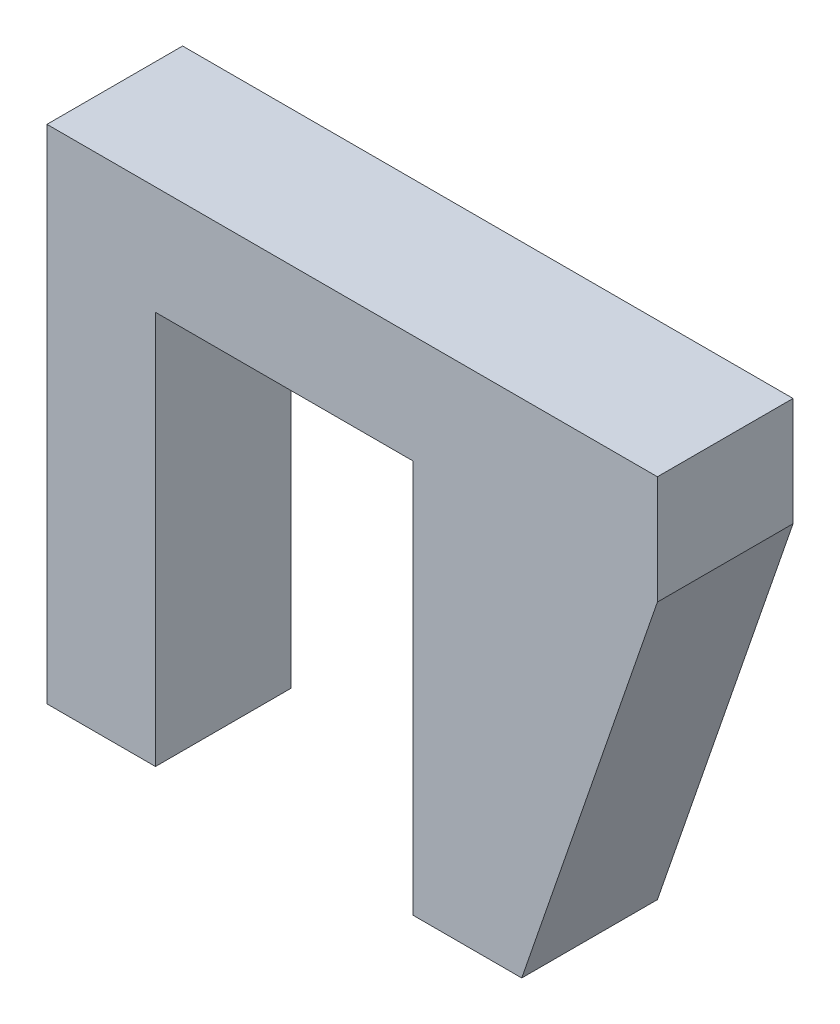
ISO-10303-21;
HEADER;
FILE_DESCRIPTION(('STEP AP214'),'2;1');
FILE_NAME('part.step','',(''),(''),'','','');
FILE_SCHEMA(('AUTOMOTIVE_DESIGN { 1 0 10303 214 1 1 1 1 }'));
ENDSEC;
DATA;
#1=APPLICATION_CONTEXT('core data for automotive mechanical design processes');
#2=APPLICATION_PROTOCOL_DEFINITION('international standard','automotive_design',2000,#1);
#3=PRODUCT_CONTEXT('',#1,'mechanical');
#4=PRODUCT('Part','Part','',(#3));
#5=PRODUCT_RELATED_PRODUCT_CATEGORY('part','',(#4));
#6=PRODUCT_DEFINITION_FORMATION('','',#4);
#7=PRODUCT_DEFINITION_CONTEXT('part definition',#1,'design');
#8=PRODUCT_DEFINITION('design','',#6,#7);
#9=PRODUCT_DEFINITION_SHAPE('','',#8);
#10=(LENGTH_UNIT() NAMED_UNIT(*) SI_UNIT(.MILLI.,.METRE.));
#11=(NAMED_UNIT(*) PLANE_ANGLE_UNIT() SI_UNIT($,.RADIAN.));
#12=(NAMED_UNIT(*) SI_UNIT($,.STERADIAN.) SOLID_ANGLE_UNIT());
#13=UNCERTAINTY_MEASURE_WITH_UNIT(LENGTH_MEASURE(1.E-05),#10,'distance_accuracy_value','');
#14=(GEOMETRIC_REPRESENTATION_CONTEXT(3) GLOBAL_UNCERTAINTY_ASSIGNED_CONTEXT((#13)) GLOBAL_UNIT_ASSIGNED_CONTEXT((#10,
#11,#12)) REPRESENTATION_CONTEXT('',''));
#15=CARTESIAN_POINT('',(0.,0.,0.));
#16=DIRECTION('',(0.,0.,1.));
#17=DIRECTION('',(1.,0.,0.));
#18=AXIS2_PLACEMENT_3D('',#15,#16,#17);
#19=CARTESIAN_POINT('',(4.75,-9.75,5.));
#20=DIRECTION('',(1.,0.,0.));
#21=DIRECTION('',(0.,1.,0.));
#22=AXIS2_PLACEMENT_3D('',#19,#20,#21);
#23=PLANE('',#22);
#24=DIRECTION('',(0.,-1.,0.));
#25=VECTOR('',#24,1.);
#26=CARTESIAN_POINT('',(4.75,-9.75,0.));
#27=LINE('',#26,#25);
#28=CARTESIAN_POINT('',(4.75,4.75,0.));
#29=VERTEX_POINT('',#28);
#30=CARTESIAN_POINT('',(4.75,-9.75,0.));
#31=VERTEX_POINT('',#30);
#32=EDGE_CURVE('E95',#29,#31,#27,.T.);
#33=ORIENTED_EDGE('',*,*,#32,.T.);
#34=DIRECTION('',(0.,0.,-1.));
#35=VECTOR('',#34,1.);
#36=CARTESIAN_POINT('',(4.75,-9.75,5.));
#37=LINE('',#36,#35);
#38=CARTESIAN_POINT('',(4.75,-9.75,5.));
#39=VERTEX_POINT('',#38);
#40=EDGE_CURVE('E12',#39,#31,#37,.T.);
#41=ORIENTED_EDGE('',*,*,#40,.F.);
#42=DIRECTION('',(0.,-1.,0.));
#43=VECTOR('',#42,1.);
#44=CARTESIAN_POINT('',(4.75,-4.75,5.));
#45=LINE('',#44,#43);
#46=CARTESIAN_POINT('',(4.75,4.75,5.));
#47=VERTEX_POINT('',#46);
#48=EDGE_CURVE('E101',#47,#39,#45,.T.);
#49=ORIENTED_EDGE('',*,*,#48,.F.);
#50=DIRECTION('',(0.,0.,-1.));
#51=VECTOR('',#50,1.);
#52=CARTESIAN_POINT('',(4.75,4.75,5.));
#53=LINE('',#52,#51);
#54=EDGE_CURVE('E143',#47,#29,#53,.T.);
#55=ORIENTED_EDGE('',*,*,#54,.T.);
#56=EDGE_LOOP('',(#33,#41,#49,#55));
#57=FACE_BOUND('',#56,.T.);
#58=ADVANCED_FACE('F40',(#57),#23,.F.);
#59=CARTESIAN_POINT('',(8.75,-9.75,5.));
#60=DIRECTION('',(0.,1.,0.));
#61=DIRECTION('',(-1.,0.,0.));
#62=AXIS2_PLACEMENT_3D('',#59,#60,#61);
#63=PLANE('',#62);
#64=DIRECTION('',(1.,0.,0.));
#65=VECTOR('',#64,1.);
#66=CARTESIAN_POINT('',(8.75,-9.75,0.));
#67=LINE('',#66,#65);
#68=CARTESIAN_POINT('',(8.75,-9.75,0.));
#69=VERTEX_POINT('',#68);
#70=EDGE_CURVE('E215',#31,#69,#67,.T.);
#71=ORIENTED_EDGE('',*,*,#70,.T.);
#72=DIRECTION('',(0.,0.,-1.));
#73=VECTOR('',#72,1.);
#74=CARTESIAN_POINT('',(8.75,-9.75,5.));
#75=LINE('',#74,#73);
#76=CARTESIAN_POINT('',(8.75,-9.75,5.));
#77=VERTEX_POINT('',#76);
#78=EDGE_CURVE('E49',#77,#69,#75,.T.);
#79=ORIENTED_EDGE('',*,*,#78,.F.);
#80=DIRECTION('',(1.,0.,0.));
#81=VECTOR('',#80,1.);
#82=CARTESIAN_POINT('',(8.75,-9.75,5.));
#83=LINE('',#82,#81);
#84=EDGE_CURVE('E171',#39,#77,#83,.T.);
#85=ORIENTED_EDGE('',*,*,#84,.F.);
#86=ORIENTED_EDGE('',*,*,#40,.T.);
#87=EDGE_LOOP('',(#71,#79,#85,#86));
#88=FACE_BOUND('',#87,.T.);
#89=ADVANCED_FACE('F243',(#88),#63,.F.);
#90=CARTESIAN_POINT('',(13.75,4.75,5.));
#91=DIRECTION('',(-0.945372981626272,0.325990683319404,0.));
#92=DIRECTION('',(-0.325990683319404,-0.945372981626272,0.));
#93=AXIS2_PLACEMENT_3D('',#90,#91,#92);
#94=PLANE('',#93);
#95=DIRECTION('',(0.325990683319404,0.945372981626272,0.));
#96=VECTOR('',#95,1.);
#97=CARTESIAN_POINT('',(13.75,4.75,0.));
#98=LINE('',#97,#96);
#99=CARTESIAN_POINT('',(13.75,4.75,0.));
#100=VERTEX_POINT('',#99);
#101=EDGE_CURVE('E210',#69,#100,#98,.T.);
#102=ORIENTED_EDGE('',*,*,#101,.T.);
#103=DIRECTION('',(0.,0.,-1.));
#104=VECTOR('',#103,1.);
#105=CARTESIAN_POINT('',(13.75,4.75,5.));
#106=LINE('',#105,#104);
#107=CARTESIAN_POINT('',(13.75,4.75,5.));
#108=VERTEX_POINT('',#107);
#109=EDGE_CURVE('E199',#108,#100,#106,.T.);
#110=ORIENTED_EDGE('',*,*,#109,.F.);
#111=DIRECTION('',(0.325990683319404,0.945372981626272,0.));
#112=VECTOR('',#111,1.);
#113=CARTESIAN_POINT('',(13.75,4.75,5.));
#114=LINE('',#113,#112);
#115=EDGE_CURVE('E164',#77,#108,#114,.T.);
#116=ORIENTED_EDGE('',*,*,#115,.F.);
#117=ORIENTED_EDGE('',*,*,#78,.T.);
#118=EDGE_LOOP('',(#102,#110,#116,#117));
#119=FACE_BOUND('',#118,.T.);
#120=ADVANCED_FACE('F208',(#119),#94,.F.);
#121=CARTESIAN_POINT('',(13.75,4.75,5.));
#122=DIRECTION('',(-1.,0.,0.));
#123=DIRECTION('',(0.,-1.,0.));
#124=AXIS2_PLACEMENT_3D('',#121,#122,#123);
#125=PLANE('',#124);
#126=DIRECTION('',(0.,1.,0.));
#127=VECTOR('',#126,1.);
#128=CARTESIAN_POINT('',(13.75,4.75,0.));
#129=LINE('',#128,#127);
#130=CARTESIAN_POINT('',(13.75,8.75,0.));
#131=VERTEX_POINT('',#130);
#132=EDGE_CURVE('E217',#100,#131,#129,.T.);
#133=ORIENTED_EDGE('',*,*,#132,.T.);
#134=DIRECTION('',(0.,0.,-1.));
#135=VECTOR('',#134,1.);
#136=CARTESIAN_POINT('',(13.75,8.75,5.));
#137=LINE('',#136,#135);
#138=CARTESIAN_POINT('',(13.75,8.75,5.));
#139=VERTEX_POINT('',#138);
#140=EDGE_CURVE('E195',#139,#131,#137,.T.);
#141=ORIENTED_EDGE('',*,*,#140,.F.);
#142=DIRECTION('',(0.,1.,0.));
#143=VECTOR('',#142,1.);
#144=CARTESIAN_POINT('',(13.75,4.75,5.));
#145=LINE('',#144,#143);
#146=EDGE_CURVE('E160',#108,#139,#145,.T.);
#147=ORIENTED_EDGE('',*,*,#146,.F.);
#148=ORIENTED_EDGE('',*,*,#109,.T.);
#149=EDGE_LOOP('',(#133,#141,#147,#148));
#150=FACE_BOUND('',#149,.T.);
#151=ADVANCED_FACE('F238',(#150),#125,.F.);
#152=CARTESIAN_POINT('',(-8.75,8.75,5.));
#153=DIRECTION('',(0.,-1.,0.));
#154=DIRECTION('',(1.,0.,0.));
#155=AXIS2_PLACEMENT_3D('',#152,#153,#154);
#156=PLANE('',#155);
#157=DIRECTION('',(-1.,0.,0.));
#158=VECTOR('',#157,1.);
#159=CARTESIAN_POINT('',(-8.75,8.75,0.));
#160=LINE('',#159,#158);
#161=CARTESIAN_POINT('',(-8.75,8.75,0.));
#162=VERTEX_POINT('',#161);
#163=EDGE_CURVE('E222',#131,#162,#160,.T.);
#164=ORIENTED_EDGE('',*,*,#163,.T.);
#165=DIRECTION('',(0.,0.,-1.));
#166=VECTOR('',#165,1.);
#167=CARTESIAN_POINT('',(-8.75,8.75,5.));
#168=LINE('',#167,#166);
#169=CARTESIAN_POINT('',(-8.75,8.75,5.));
#170=VERTEX_POINT('',#169);
#171=EDGE_CURVE('E191',#170,#162,#168,.T.);
#172=ORIENTED_EDGE('',*,*,#171,.F.);
#173=DIRECTION('',(-1.,0.,0.));
#174=VECTOR('',#173,1.);
#175=CARTESIAN_POINT('',(13.75,8.75,5.));
#176=LINE('',#175,#174);
#177=EDGE_CURVE('E156',#139,#170,#176,.T.);
#178=ORIENTED_EDGE('',*,*,#177,.F.);
#179=ORIENTED_EDGE('',*,*,#140,.T.);
#180=EDGE_LOOP('',(#164,#172,#178,#179));
#181=FACE_BOUND('',#180,.T.);
#182=ADVANCED_FACE('F241',(#181),#156,.F.);
#183=CARTESIAN_POINT('',(-8.75,-9.75,5.));
#184=DIRECTION('',(1.,0.,0.));
#185=DIRECTION('',(0.,0.,-1.));
#186=AXIS2_PLACEMENT_3D('',#183,#184,#185);
#187=PLANE('',#186);
#188=DIRECTION('',(0.,-1.,0.));
#189=VECTOR('',#188,1.);
#190=CARTESIAN_POINT('',(-8.75,-9.75,0.));
#191=LINE('',#190,#189);
#192=CARTESIAN_POINT('',(-8.75,-9.75,0.));
#193=VERTEX_POINT('',#192);
#194=EDGE_CURVE('E228',#162,#193,#191,.T.);
#195=ORIENTED_EDGE('',*,*,#194,.T.);
#196=DIRECTION('',(0.,0.,-1.));
#197=VECTOR('',#196,1.);
#198=CARTESIAN_POINT('',(-8.75,-9.75,5.));
#199=LINE('',#198,#197);
#200=CARTESIAN_POINT('',(-8.75,-9.75,5.));
#201=VERTEX_POINT('',#200);
#202=EDGE_CURVE('E136',#201,#193,#199,.T.);
#203=ORIENTED_EDGE('',*,*,#202,.F.);
#204=DIRECTION('',(0.,-1.,0.));
#205=VECTOR('',#204,1.);
#206=CARTESIAN_POINT('',(-8.75,-9.75,5.));
#207=LINE('',#206,#205);
#208=EDGE_CURVE('E124',#170,#201,#207,.T.);
#209=ORIENTED_EDGE('',*,*,#208,.F.);
#210=ORIENTED_EDGE('',*,*,#171,.T.);
#211=EDGE_LOOP('',(#195,#203,#209,#210));
#212=FACE_BOUND('',#211,.T.);
#213=ADVANCED_FACE('F233',(#212),#187,.F.);
#214=CARTESIAN_POINT('',(-4.75,-9.75,5.));
#215=DIRECTION('',(0.,1.,0.));
#216=DIRECTION('',(-1.,0.,0.));
#217=AXIS2_PLACEMENT_3D('',#214,#215,#216);
#218=PLANE('',#217);
#219=DIRECTION('',(1.,0.,0.));
#220=VECTOR('',#219,1.);
#221=CARTESIAN_POINT('',(-4.75,-9.75,0.));
#222=LINE('',#221,#220);
#223=CARTESIAN_POINT('',(-4.75,-9.75,0.));
#224=VERTEX_POINT('',#223);
#225=EDGE_CURVE('E134',#193,#224,#222,.T.);
#226=ORIENTED_EDGE('',*,*,#225,.T.);
#227=DIRECTION('',(0.,0.,-1.));
#228=VECTOR('',#227,1.);
#229=CARTESIAN_POINT('',(-4.75,-9.75,5.));
#230=LINE('',#229,#228);
#231=CARTESIAN_POINT('',(-4.75,-9.75,5.));
#232=VERTEX_POINT('',#231);
#233=EDGE_CURVE('E131',#232,#224,#230,.T.);
#234=ORIENTED_EDGE('',*,*,#233,.F.);
#235=DIRECTION('',(1.,0.,0.));
#236=VECTOR('',#235,1.);
#237=CARTESIAN_POINT('',(-4.75,-9.75,5.));
#238=LINE('',#237,#236);
#239=EDGE_CURVE('E118',#201,#232,#238,.T.);
#240=ORIENTED_EDGE('',*,*,#239,.F.);
#241=ORIENTED_EDGE('',*,*,#202,.T.);
#242=EDGE_LOOP('',(#226,#234,#240,#241));
#243=FACE_BOUND('',#242,.T.);
#244=ADVANCED_FACE('F132',(#243),#218,.F.);
#245=CARTESIAN_POINT('',(-4.75,-4.75,5.));
#246=DIRECTION('',(-1.,0.,0.));
#247=DIRECTION('',(0.,0.,1.));
#248=AXIS2_PLACEMENT_3D('',#245,#246,#247);
#249=PLANE('',#248);
#250=DIRECTION('',(0.,1.,0.));
#251=VECTOR('',#250,1.);
#252=CARTESIAN_POINT('',(-4.75,-4.75,0.));
#253=LINE('',#252,#251);
#254=CARTESIAN_POINT('',(-4.75,4.75,0.));
#255=VERTEX_POINT('',#254);
#256=EDGE_CURVE('E88',#224,#255,#253,.T.);
#257=ORIENTED_EDGE('',*,*,#256,.T.);
#258=DIRECTION('',(0.,0.,-1.));
#259=VECTOR('',#258,1.);
#260=CARTESIAN_POINT('',(-4.75,4.75,5.));
#261=LINE('',#260,#259);
#262=CARTESIAN_POINT('',(-4.75,4.75,5.));
#263=VERTEX_POINT('',#262);
#264=EDGE_CURVE('E137',#263,#255,#261,.T.);
#265=ORIENTED_EDGE('',*,*,#264,.F.);
#266=DIRECTION('',(0.,1.,0.));
#267=VECTOR('',#266,1.);
#268=CARTESIAN_POINT('',(-4.75,-4.75,5.));
#269=LINE('',#268,#267);
#270=EDGE_CURVE('E122',#232,#263,#269,.T.);
#271=ORIENTED_EDGE('',*,*,#270,.F.);
#272=ORIENTED_EDGE('',*,*,#233,.T.);
#273=EDGE_LOOP('',(#257,#265,#271,#272));
#274=FACE_BOUND('',#273,.T.);
#275=ADVANCED_FACE('F139',(#274),#249,.F.);
#276=CARTESIAN_POINT('',(-4.75,4.75,5.));
#277=DIRECTION('',(0.,1.,0.));
#278=DIRECTION('',(-1.,0.,0.));
#279=AXIS2_PLACEMENT_3D('',#276,#277,#278);
#280=PLANE('',#279);
#281=DIRECTION('',(1.,0.,0.));
#282=VECTOR('',#281,1.);
#283=CARTESIAN_POINT('',(-4.75,4.75,0.));
#284=LINE('',#283,#282);
#285=EDGE_CURVE('E176',#255,#29,#284,.T.);
#286=ORIENTED_EDGE('',*,*,#285,.T.);
#287=ORIENTED_EDGE('',*,*,#54,.F.);
#288=DIRECTION('',(1.,0.,0.));
#289=VECTOR('',#288,1.);
#290=CARTESIAN_POINT('',(-4.75,4.75,5.));
#291=LINE('',#290,#289);
#292=EDGE_CURVE('E57',#263,#47,#291,.T.);
#293=ORIENTED_EDGE('',*,*,#292,.F.);
#294=ORIENTED_EDGE('',*,*,#264,.T.);
#295=EDGE_LOOP('',(#286,#287,#293,#294));
#296=FACE_BOUND('',#295,.T.);
#297=ADVANCED_FACE('F246',(#296),#280,.F.);
#298=CARTESIAN_POINT('',(0.,0.,5.));
#299=DIRECTION('',(0.,0.,-1.));
#300=DIRECTION('',(-1.,0.,0.));
#301=AXIS2_PLACEMENT_3D('',#298,#299,#300);
#302=PLANE('',#301);
#303=ORIENTED_EDGE('',*,*,#48,.T.);
#304=ORIENTED_EDGE('',*,*,#84,.T.);
#305=ORIENTED_EDGE('',*,*,#115,.T.);
#306=ORIENTED_EDGE('',*,*,#146,.T.);
#307=ORIENTED_EDGE('',*,*,#177,.T.);
#308=ORIENTED_EDGE('',*,*,#208,.T.);
#309=ORIENTED_EDGE('',*,*,#239,.T.);
#310=ORIENTED_EDGE('',*,*,#270,.T.);
#311=ORIENTED_EDGE('',*,*,#292,.T.);
#312=EDGE_LOOP('',(#303,#304,#305,#306,#307,#308,#309,#310,#311));
#313=FACE_BOUND('',#312,.T.);
#314=ADVANCED_FACE('F120',(#313),#302,.F.);
#315=CARTESIAN_POINT('',(0.,0.,0.));
#316=DIRECTION('',(0.,0.,-1.));
#317=DIRECTION('',(-1.,0.,0.));
#318=AXIS2_PLACEMENT_3D('',#315,#316,#317);
#319=PLANE('',#318);
#320=ORIENTED_EDGE('',*,*,#32,.F.);
#321=ORIENTED_EDGE('',*,*,#285,.F.);
#322=ORIENTED_EDGE('',*,*,#256,.F.);
#323=ORIENTED_EDGE('',*,*,#225,.F.);
#324=ORIENTED_EDGE('',*,*,#194,.F.);
#325=ORIENTED_EDGE('',*,*,#163,.F.);
#326=ORIENTED_EDGE('',*,*,#132,.F.);
#327=ORIENTED_EDGE('',*,*,#101,.F.);
#328=ORIENTED_EDGE('',*,*,#70,.F.);
#329=EDGE_LOOP('',(#320,#321,#322,#323,#324,#325,#326,#327,#328));
#330=FACE_BOUND('',#329,.T.);
#331=ADVANCED_FACE('F214',(#330),#319,.T.);
#332=CLOSED_SHELL('',(#58,#89,#120,#151,#182,#213,#244,#275,#297,#314,#331));
#333=MANIFOLD_SOLID_BREP('B2',#332);
#334=ADVANCED_BREP_SHAPE_REPRESENTATION('',(#18,#333),#14);
#335=SHAPE_DEFINITION_REPRESENTATION(#9,#334);
ENDSEC;
END-ISO-10303-21;
